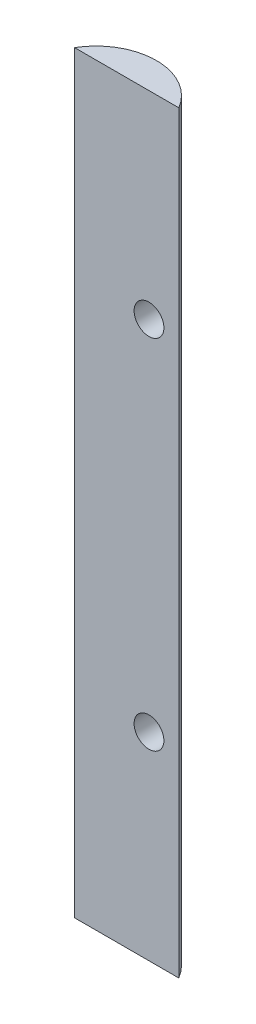
ISO-10303-21;
HEADER;
FILE_DESCRIPTION(('STEP AP214'),'2;1');
FILE_NAME('part.step','',(''),(''),'','','');
FILE_SCHEMA(('AUTOMOTIVE_DESIGN { 1 0 10303 214 1 1 1 1 }'));
ENDSEC;
DATA;
#1=APPLICATION_CONTEXT('core data for automotive mechanical design processes');
#2=APPLICATION_PROTOCOL_DEFINITION('international standard','automotive_design',2000,#1);
#3=PRODUCT_CONTEXT('',#1,'mechanical');
#4=PRODUCT('Part','Part','',(#3));
#5=PRODUCT_RELATED_PRODUCT_CATEGORY('part','',(#4));
#6=PRODUCT_DEFINITION_FORMATION('','',#4);
#7=PRODUCT_DEFINITION_CONTEXT('part definition',#1,'design');
#8=PRODUCT_DEFINITION('design','',#6,#7);
#9=PRODUCT_DEFINITION_SHAPE('','',#8);
#10=(LENGTH_UNIT() NAMED_UNIT(*) SI_UNIT(.MILLI.,.METRE.));
#11=(NAMED_UNIT(*) PLANE_ANGLE_UNIT() SI_UNIT($,.RADIAN.));
#12=(NAMED_UNIT(*) SI_UNIT($,.STERADIAN.) SOLID_ANGLE_UNIT());
#13=UNCERTAINTY_MEASURE_WITH_UNIT(LENGTH_MEASURE(1.E-05),#10,'distance_accuracy_value','');
#14=(GEOMETRIC_REPRESENTATION_CONTEXT(3) GLOBAL_UNCERTAINTY_ASSIGNED_CONTEXT((#13)) GLOBAL_UNIT_ASSIGNED_CONTEXT((#10,
#11,#12)) REPRESENTATION_CONTEXT('',''));
#15=CARTESIAN_POINT('',(0.,0.,0.));
#16=DIRECTION('',(0.,0.,1.));
#17=DIRECTION('',(1.,0.,0.));
#18=AXIS2_PLACEMENT_3D('',#15,#16,#17);
#19=CARTESIAN_POINT('',(0.,154.301952,0.));
#20=DIRECTION('',(0.,0.,-1.));
#21=DIRECTION('',(-1.,0.,0.));
#22=AXIS2_PLACEMENT_3D('',#19,#20,#21);
#23=PLANE('',#22);
#24=CARTESIAN_POINT('',(0.,35.875976,0.));
#25=DIRECTION('',(0.,0.,1.));
#26=DIRECTION('',(1.,0.,0.));
#27=AXIS2_PLACEMENT_3D('',#24,#25,#26);
#28=CIRCLE('',#27,3.17499999999999);
#29=CARTESIAN_POINT('',(3.17499999999999,35.875976,0.));
#30=VERTEX_POINT('',#29);
#31=EDGE_CURVE('E99',#30,#30,#28,.T.);
#32=ORIENTED_EDGE('',*,*,#31,.F.);
#33=EDGE_LOOP('',(#32));
#34=FACE_BOUND('',#33,.T.);
#35=CARTESIAN_POINT('',(0.,112.075976,0.));
#36=DIRECTION('',(0.,0.,1.));
#37=DIRECTION('',(1.,0.,0.));
#38=AXIS2_PLACEMENT_3D('',#35,#36,#37);
#39=CIRCLE('',#38,3.17499999999999);
#40=CARTESIAN_POINT('',(3.17499999999998,112.075976,0.));
#41=VERTEX_POINT('',#40);
#42=EDGE_CURVE('E125',#41,#41,#39,.T.);
#43=ORIENTED_EDGE('',*,*,#42,.F.);
#44=EDGE_LOOP('',(#43));
#45=FACE_BOUND('',#44,.T.);
#46=DIRECTION('',(1.,0.,0.));
#47=VECTOR('',#46,1.);
#48=CARTESIAN_POINT('',(0.,-6.35,0.));
#49=LINE('',#48,#47);
#50=CARTESIAN_POINT('',(-15.875,-6.35,0.));
#51=VERTEX_POINT('',#50);
#52=CARTESIAN_POINT('',(6.35,-6.35,0.));
#53=VERTEX_POINT('',#52);
#54=EDGE_CURVE('E74',#51,#53,#49,.T.);
#55=ORIENTED_EDGE('',*,*,#54,.T.);
#56=DIRECTION('',(0.,-1.,0.));
#57=VECTOR('',#56,1.);
#58=CARTESIAN_POINT('',(6.35,154.301952,0.));
#59=LINE('',#58,#57);
#60=CARTESIAN_POINT('',(6.35,154.301952,0.));
#61=VERTEX_POINT('',#60);
#62=EDGE_CURVE('E11',#61,#53,#59,.T.);
#63=ORIENTED_EDGE('',*,*,#62,.F.);
#64=DIRECTION('',(1.,0.,0.));
#65=VECTOR('',#64,1.);
#66=CARTESIAN_POINT('',(0.,154.301952,0.));
#67=LINE('',#66,#65);
#68=CARTESIAN_POINT('',(-15.875,154.301952,0.));
#69=VERTEX_POINT('',#68);
#70=EDGE_CURVE('E86',#69,#61,#67,.T.);
#71=ORIENTED_EDGE('',*,*,#70,.F.);
#72=DIRECTION('',(0.,-1.,0.));
#73=VECTOR('',#72,1.);
#74=CARTESIAN_POINT('',(-15.875,154.301952,0.));
#75=LINE('',#74,#73);
#76=EDGE_CURVE('E57',#69,#51,#75,.T.);
#77=ORIENTED_EDGE('',*,*,#76,.T.);
#78=EDGE_LOOP('',(#55,#63,#71,#77));
#79=FACE_BOUND('',#78,.T.);
#80=ADVANCED_FACE('F43',(#34,#45,#79),#23,.F.);
#81=CARTESIAN_POINT('',(-4.7625,154.301952,6.5484375));
#82=DIRECTION('',(0.,-1.,0.));
#83=DIRECTION('',(0.,0.,-1.));
#84=AXIS2_PLACEMENT_3D('',#81,#82,#83);
#85=CYLINDRICAL_SURFACE('',#84,12.8984375);
#86=CARTESIAN_POINT('',(3.17499999999999,35.875976,-3.61845896310054));
#87=CARTESIAN_POINT('',(3.17500029155845,35.9532460701708,-3.61845865162707));
#88=CARTESIAN_POINT('',(3.17217494628215,36.0305127414857,-3.62066641748479));
#89=CARTESIAN_POINT('',(3.16092477458739,36.1844165006741,-3.62943459894673));
#90=CARTESIAN_POINT('',(3.15249779231336,36.2610533346468,-3.6359966903624));
#91=CARTESIAN_POINT('',(3.13018830916981,36.4130458067568,-3.65329567583613));
#92=CARTESIAN_POINT('',(3.11630605119873,36.4884015017814,-3.66403238401741));
#93=CARTESIAN_POINT('',(3.08331514599963,36.6373033946925,-3.68939941002584));
#94=CARTESIAN_POINT('',(3.06420415714725,36.7108487657243,-3.7040314722612));
#95=CARTESIAN_POINT('',(2.99970218374854,36.9271174174017,-3.75305885545857));
#96=CARTESIAN_POINT('',(2.94697916438839,37.0665468482926,-3.79271518717727));
#97=CARTESIAN_POINT('',(2.82442881282292,37.3336781756134,-3.88295570262731));
#98=CARTESIAN_POINT('',(2.7545956444484,37.4613760500019,-3.93354361435852));
#99=CARTESIAN_POINT('',(2.59237992999635,37.7158578374709,-4.04808197326832));
#100=CARTESIAN_POINT('',(2.49844020076017,37.8412715954862,-4.11286301294359));
#101=CARTESIAN_POINT('',(2.29521823437964,38.0752138533229,-4.24847208060614));
#102=CARTESIAN_POINT('',(2.18592793531069,38.183733416977,-4.31930327835023));
#103=CARTESIAN_POINT('',(1.93138065942859,38.4025908557397,-4.47826997752821));
#104=CARTESIAN_POINT('',(1.78326915895043,38.5091374108075,-4.56708150040062));
#105=CARTESIAN_POINT('',(1.47119073823516,38.6954278022771,-4.74506321575416));
#106=CARTESIAN_POINT('',(1.30721296467085,38.7751531223092,-4.83423361318672));
#107=CARTESIAN_POINT('',(0.951295750286282,38.9116014809198,-5.01726678919524));
#108=CARTESIAN_POINT('',(0.758165872020517,38.9656695573429,-5.11084798187377));
#109=CARTESIAN_POINT('',(0.461109140868173,39.0189307940601,-5.24544016431096));
#110=CARTESIAN_POINT('',(0.360810762795933,39.0320439716694,-5.28936166307805));
#111=CARTESIAN_POINT('',(0.15846509509223,39.0486403343744,-5.37489298816599));
#112=CARTESIAN_POINT('',(0.0564187624306947,39.0521286293902,-5.41650402962234));
#113=CARTESIAN_POINT('',(-0.143697886170491,39.049225369538,-5.49512385220796));
#114=CARTESIAN_POINT('',(-0.241726201201153,39.0432962697464,-5.53225742551915));
#115=CARTESIAN_POINT('',(-0.437737274208508,39.0221990611551,-5.60380473376646));
#116=CARTESIAN_POINT('',(-0.535720030560133,39.0070355550416,-5.63821981402773));
#117=CARTESIAN_POINT('',(-0.730737999312872,38.9673423451485,-5.70412048241188));
#118=CARTESIAN_POINT('',(-0.827773509636955,38.9428156903861,-5.73560702003919));
#119=CARTESIAN_POINT('',(-1.0199433424238,38.8843681928637,-5.79551187375221));
#120=CARTESIAN_POINT('',(-1.11507785488985,38.8504482940378,-5.82393049773622));
#121=CARTESIAN_POINT('',(-1.2932752926261,38.7770830333219,-5.8750043601246));
#122=CARTESIAN_POINT('',(-1.3766104012884,38.7384996486948,-5.89795138845065));
#123=CARTESIAN_POINT('',(-1.54016736468118,38.6539228516425,-5.94129517591087));
#124=CARTESIAN_POINT('',(-1.62038811983223,38.6079268510579,-5.96169103985667));
#125=CARTESIAN_POINT('',(-1.77687845129753,38.5088252250418,-5.99995831517187));
#126=CARTESIAN_POINT('',(-1.85315059963564,38.4557243104882,-6.01783138326943));
#127=CARTESIAN_POINT('',(-2.00107961503945,38.3427521830638,-6.05116594048672));
#128=CARTESIAN_POINT('',(-2.07273482176761,38.282878555695,-6.06662656485746));
#129=CARTESIAN_POINT('',(-2.27159400513747,38.1011379662489,-6.10788997306091));
#130=CARTESIAN_POINT('',(-2.39212476680084,37.9711238078877,-6.13080529239027));
#131=CARTESIAN_POINT('',(-2.61018571307227,37.6922716410865,-6.169643174857));
#132=CARTESIAN_POINT('',(-2.70771789937332,37.5434352725808,-6.18556634666365));
#133=CARTESIAN_POINT('',(-2.87574692225581,37.2329877816891,-6.21153952657473));
#134=CARTESIAN_POINT('',(-2.94654490001103,37.0715453031202,-6.22165566629257));
#135=CARTESIAN_POINT('',(-3.06051426189999,36.7389839302186,-6.23734638899209));
#136=CARTESIAN_POINT('',(-3.1036851570565,36.5678648646765,-6.24292089159091));
#137=CARTESIAN_POINT('',(-3.16124439987612,36.2200206249881,-6.25025492095319));
#138=CARTESIAN_POINT('',(-3.17550914635836,36.0432746451871,-6.25199806771476));
#139=CARTESIAN_POINT('',(-3.17446299904402,35.6898690405533,-6.25186828729976));
#140=CARTESIAN_POINT('',(-3.1591514595007,35.5132094176902,-6.24999528117078));
#141=CARTESIAN_POINT('',(-3.09932960260838,35.1645382371296,-6.24235818988753));
#142=CARTESIAN_POINT('',(-3.05474731888306,34.9925392263368,-6.2365845133512));
#143=CARTESIAN_POINT('',(-2.93765612238383,34.6585555683284,-6.22039579970276));
#144=CARTESIAN_POINT('',(-2.8651476977294,34.4965707461328,-6.20998084371483));
#145=CARTESIAN_POINT('',(-2.69464055060395,34.1876044041569,-6.18345321124056));
#146=CARTESIAN_POINT('',(-2.59669886748819,34.0405903236084,-6.16735325583885));
#147=CARTESIAN_POINT('',(-2.37838771763342,33.7653493257539,-6.12823219486351));
#148=CARTESIAN_POINT('',(-2.25802014982715,33.6371208194028,-6.10521167519394));
#149=CARTESIAN_POINT('',(-1.99941744380487,33.4034910568398,-6.05126056417378));
#150=CARTESIAN_POINT('',(-1.86126578240751,33.2979889483569,-6.02036630640185));
#151=CARTESIAN_POINT('',(-1.57125841800309,33.1116529132524,-5.94987856073665));
#152=CARTESIAN_POINT('',(-1.41940302371465,33.0308184310966,-5.910285268787));
#153=CARTESIAN_POINT('',(-1.1055099451504,32.8947009667696,-5.82180553620153));
#154=CARTESIAN_POINT('',(-0.943393885269857,32.8396510085681,-5.77283977329668));
#155=CARTESIAN_POINT('',(-0.615164246925477,32.7565397418925,-5.66627030457636));
#156=CARTESIAN_POINT('',(-0.449049882986556,32.7284837815405,-5.60866488966228));
#157=CARTESIAN_POINT('',(-0.109458564307639,32.6980725021982,-5.4829048252979));
#158=CARTESIAN_POINT('',(0.063994138427292,32.6969984952479,-5.41437955571862));
#159=CARTESIAN_POINT('',(0.406009243876506,32.7223713421909,-5.27064333297133));
#160=CARTESIAN_POINT('',(0.574570106965336,32.748826765999,-5.1954303045711));
#161=CARTESIAN_POINT('',(0.917794182473879,32.8309643448933,-5.03357505540364));
#162=CARTESIAN_POINT('',(1.09169140536315,32.8890111406032,-4.9465093365185));
#163=CARTESIAN_POINT('',(1.42611850843885,33.0334354511295,-4.76997774068824));
#164=CARTESIAN_POINT('',(1.58663659159165,33.1198376437102,-4.68050983561371));
#165=CARTESIAN_POINT('',(1.90346369918747,33.3272184478596,-4.49560605638029));
#166=CARTESIAN_POINT('',(2.05837804151772,33.4504312658432,-4.40027394193835));
#167=CARTESIAN_POINT('',(2.34470378385709,33.7260021221634,-4.21660928889522));
#168=CARTESIAN_POINT('',(2.4761352154676,33.8783350883122,-4.12827082068667));
#169=CARTESIAN_POINT('',(2.68414340342812,34.1727947747334,-3.98386963689914));
#170=CARTESIAN_POINT('',(2.76641145809164,34.3095436202933,-3.92501222527243));
#171=CARTESIAN_POINT('',(2.91081345377314,34.5978315173857,-3.81968463242392));
#172=CARTESIAN_POINT('',(2.97296687081608,34.7493560761584,-3.7732024766262));
#173=CARTESIAN_POINT('',(3.04804529007878,34.9834502824975,-3.71635786454596));
#174=CARTESIAN_POINT('',(3.06990380991776,35.0617339415551,-3.69966984511348));
#175=CARTESIAN_POINT('',(3.10767219938744,35.2205056158014,-3.67069401211238));
#176=CARTESIAN_POINT('',(3.12358517824932,35.30099245513,-3.65840389879346));
#177=CARTESIAN_POINT('',(3.14916600743887,35.4634917928754,-3.63858824894905));
#178=CARTESIAN_POINT('',(3.15883683517378,35.545503544699,-3.63106044091348));
#179=CARTESIAN_POINT('',(3.17175344510506,35.7103368714405,-3.62099614366396));
#180=CARTESIAN_POINT('',(3.17499968750934,35.7931583879259,-3.618459296936));
#181=CARTESIAN_POINT('',(3.17499999999999,35.875976,-3.61845896310054));
#182=B_SPLINE_CURVE_WITH_KNOTS('',3,(#86,#87,#88,#89,#90,#91,#92,#93,#94,#95,#96,#97,#98,#99,
#100,#101,#102,#103,#104,#105,#106,#107,#108,#109,#110,#111,#112,#113,#114,#115,#116,#117,#118,
#119,#120,#121,#122,#123,#124,#125,#126,#127,#128,#129,#130,#131,#132,#133,#134,#135,#136,#137,
#138,#139,#140,#141,#142,#143,#144,#145,#146,#147,#148,#149,#150,#151,#152,#153,#154,#155,#156,
#157,#158,#159,#160,#161,#162,#163,#164,#165,#166,#167,#168,#169,#170,#171,#172,#173,#174,#175,
#176,#177,#178,#179,#180,#181),.UNSPECIFIED.,.T.,.F.,(4,2,2,2,2,2,2,2,2,2,2,2,2,2,2,2,2,2,2,2,2,
2,2,2,2,2,2,2,2,2,2,2,2,2,2,2,2,2,2,2,2,2,2,2,2,2,2,4),(0.,0.23172170254418,0.463532637571479,
0.695333252289376,0.927237846532124,1.38780878735856,1.84853704540815,2.35536912389957,
2.86246838644238,3.46869500436954,4.07533928356594,4.735587075844,5.0660447042575,
5.39632685652518,5.71088488491669,6.02528625696997,6.33958533452528,6.65385283938741,
6.93745872275159,7.22116384420984,7.50468178004908,7.78830111158174,8.32177184268101,
8.8551961257254,9.38241858057932,9.90965036659034,10.439131851098,10.9686248960431,
11.4994246762914,12.0302151791403,12.5598254035064,13.0893908029968,13.6165554088367,
14.1437081416398,14.6755371559432,15.2074715159301,15.7646208143044,16.3219436052166,
16.9282554412655,17.5350963574278,18.1911032211856,18.8465477923047,19.3549401883814,
19.8628388497612,20.1114634329343,20.3599578148523,20.6083335811238,20.8566915550203),.UNSPECIFIED.);
#183=CARTESIAN_POINT('',(3.17499999999999,35.875976,-3.61845896310054));
#184=VERTEX_POINT('',#183);
#185=EDGE_CURVE('E46',#184,#184,#182,.T.);
#186=ORIENTED_EDGE('',*,*,#185,.T.);
#187=EDGE_LOOP('',(#186));
#188=FACE_BOUND('',#187,.T.);
#189=CARTESIAN_POINT('',(3.17499999999998,112.075976,-3.61845896310055));
#190=CARTESIAN_POINT('',(3.17500029155843,112.153246070171,-3.61845865162708));
#191=CARTESIAN_POINT('',(3.17217494628213,112.230512741486,-3.6206664174848));
#192=CARTESIAN_POINT('',(3.16092477458737,112.384416500674,-3.62943459894674));
#193=CARTESIAN_POINT('',(3.15249779231334,112.461053334647,-3.63599669036241));
#194=CARTESIAN_POINT('',(3.1301883091698,112.613045806757,-3.65329567583614));
#195=CARTESIAN_POINT('',(3.11630605119871,112.688401501781,-3.66403238401741));
#196=CARTESIAN_POINT('',(3.08331514599962,112.837303394693,-3.68939941002585));
#197=CARTESIAN_POINT('',(3.06420415714724,112.910848765724,-3.70403147226121));
#198=CARTESIAN_POINT('',(2.99970218374853,113.127117417402,-3.75305885545858));
#199=CARTESIAN_POINT('',(2.94697916438838,113.266546848293,-3.79271518717729));
#200=CARTESIAN_POINT('',(2.8244288128229,113.533678175613,-3.88295570262733));
#201=CARTESIAN_POINT('',(2.75459564444838,113.661376050002,-3.93354361435853));
#202=CARTESIAN_POINT('',(2.59237992999633,113.915857837471,-4.04808197326834));
#203=CARTESIAN_POINT('',(2.49844020076014,114.041271595486,-4.1128630129436));
#204=CARTESIAN_POINT('',(2.29521823437962,114.275213853323,-4.24847208060616));
#205=CARTESIAN_POINT('',(2.18592793531068,114.383733416977,-4.31930327835023));
#206=CARTESIAN_POINT('',(1.93138065942857,114.60259085574,-4.47826997752822));
#207=CARTESIAN_POINT('',(1.78326915895041,114.709137410808,-4.56708150040063));
#208=CARTESIAN_POINT('',(1.47119073823514,114.895427802277,-4.74506321575417));
#209=CARTESIAN_POINT('',(1.30721296467083,114.975153122309,-4.83423361318673));
#210=CARTESIAN_POINT('',(0.951295750286266,115.11160148092,-5.01726678919525));
#211=CARTESIAN_POINT('',(0.7581658720205,115.165669557343,-5.11084798187378));
#212=CARTESIAN_POINT('',(0.461109140868153,115.21893079406,-5.24544016431097));
#213=CARTESIAN_POINT('',(0.360810762795913,115.232043971669,-5.28936166307805));
#214=CARTESIAN_POINT('',(0.158465095092209,115.248640334374,-5.374892988166));
#215=CARTESIAN_POINT('',(0.0564187624306733,115.25212862939,-5.41650402962235));
#216=CARTESIAN_POINT('',(-0.143697886170512,115.249225369538,-5.49512385220797));
#217=CARTESIAN_POINT('',(-0.241726201201174,115.243296269746,-5.53225742551916));
#218=CARTESIAN_POINT('',(-0.437737274208529,115.222199061155,-5.60380473376646));
#219=CARTESIAN_POINT('',(-0.535720030560155,115.207035555042,-5.63821981402774));
#220=CARTESIAN_POINT('',(-0.730737999312894,115.167342345149,-5.70412048241189));
#221=CARTESIAN_POINT('',(-0.827773509636976,115.142815690386,-5.7356070200392));
#222=CARTESIAN_POINT('',(-1.01994334242381,115.084368192864,-5.79551187375221));
#223=CARTESIAN_POINT('',(-1.11507785488987,115.050448294038,-5.82393049773622));
#224=CARTESIAN_POINT('',(-1.29327529262612,114.977083033322,-5.8750043601246));
#225=CARTESIAN_POINT('',(-1.37661040128841,114.938499648695,-5.89795138845065));
#226=CARTESIAN_POINT('',(-1.54016736468119,114.853922851643,-5.94129517591087));
#227=CARTESIAN_POINT('',(-1.62038811983224,114.807926851058,-5.96169103985667));
#228=CARTESIAN_POINT('',(-1.77687845129754,114.708825225042,-5.99995831517187));
#229=CARTESIAN_POINT('',(-1.85315059963566,114.655724310488,-6.01783138326944));
#230=CARTESIAN_POINT('',(-2.00107961503946,114.542752183064,-6.05116594048672));
#231=CARTESIAN_POINT('',(-2.07273482176763,114.482878555695,-6.06662656485746));
#232=CARTESIAN_POINT('',(-2.27159400513748,114.301137966249,-6.10788997306092));
#233=CARTESIAN_POINT('',(-2.39212476680085,114.171123807888,-6.13080529239027));
#234=CARTESIAN_POINT('',(-2.61018571307228,113.892271641086,-6.169643174857));
#235=CARTESIAN_POINT('',(-2.70771789937333,113.743435272581,-6.18556634666366));
#236=CARTESIAN_POINT('',(-2.87574692225583,113.432987781689,-6.21153952657473));
#237=CARTESIAN_POINT('',(-2.94654490001105,113.27154530312,-6.22165566629257));
#238=CARTESIAN_POINT('',(-3.06051426190001,112.938983930219,-6.2373463889921));
#239=CARTESIAN_POINT('',(-3.10368515705652,112.767864864676,-6.24292089159092));
#240=CARTESIAN_POINT('',(-3.16124439987613,112.420020624988,-6.25025492095319));
#241=CARTESIAN_POINT('',(-3.17550914635837,112.243274645187,-6.25199806771476));
#242=CARTESIAN_POINT('',(-3.17446299904403,111.889869040553,-6.25186828729976));
#243=CARTESIAN_POINT('',(-3.15915145950071,111.71320941769,-6.24999528117079));
#244=CARTESIAN_POINT('',(-3.09932960260839,111.36453823713,-6.24235818988753));
#245=CARTESIAN_POINT('',(-3.05474731888307,111.192539226337,-6.2365845133512));
#246=CARTESIAN_POINT('',(-2.93765612238384,110.858555568328,-6.22039579970276));
#247=CARTESIAN_POINT('',(-2.86514769772941,110.696570746133,-6.20998084371483));
#248=CARTESIAN_POINT('',(-2.69464055060396,110.387604404157,-6.18345321124056));
#249=CARTESIAN_POINT('',(-2.5966988674882,110.240590323608,-6.16735325583885));
#250=CARTESIAN_POINT('',(-2.37838771763343,109.965349325754,-6.12823219486352));
#251=CARTESIAN_POINT('',(-2.25802014982716,109.837120819403,-6.10521167519394));
#252=CARTESIAN_POINT('',(-1.99941744380488,109.60349105684,-6.05126056417378));
#253=CARTESIAN_POINT('',(-1.86126578240752,109.497988948357,-6.02036630640185));
#254=CARTESIAN_POINT('',(-1.5712584180031,109.311652913252,-5.94987856073665));
#255=CARTESIAN_POINT('',(-1.41940302371466,109.230818431097,-5.91028526878701));
#256=CARTESIAN_POINT('',(-1.10550994515041,109.09470096677,-5.82180553620153));
#257=CARTESIAN_POINT('',(-0.943393885269866,109.039651008568,-5.77283977329668));
#258=CARTESIAN_POINT('',(-0.615164246925485,108.956539741892,-5.66627030457636));
#259=CARTESIAN_POINT('',(-0.449049882986565,108.92848378154,-5.60866488966228));
#260=CARTESIAN_POINT('',(-0.109458564307648,108.898072502198,-5.4829048252979));
#261=CARTESIAN_POINT('',(0.063994138427282,108.896998495248,-5.41437955571862));
#262=CARTESIAN_POINT('',(0.406009243876495,108.922371342191,-5.27064333297133));
#263=CARTESIAN_POINT('',(0.574570106965326,108.948826765999,-5.19543030457111));
#264=CARTESIAN_POINT('',(0.91779418247387,109.030964344893,-5.03357505540365));
#265=CARTESIAN_POINT('',(1.09169140536314,109.089011140603,-4.94650933651851));
#266=CARTESIAN_POINT('',(1.42611850843885,109.233435451129,-4.76997774068824));
#267=CARTESIAN_POINT('',(1.58663659159164,109.31983764371,-4.68050983561371));
#268=CARTESIAN_POINT('',(1.90346369918746,109.52721844786,-4.4956060563803));
#269=CARTESIAN_POINT('',(2.05837804151771,109.650431265843,-4.40027394193836));
#270=CARTESIAN_POINT('',(2.34470378385708,109.926002122163,-4.21660928889523));
#271=CARTESIAN_POINT('',(2.47613521546759,110.078335088312,-4.12827082068668));
#272=CARTESIAN_POINT('',(2.6841434034281,110.372794774733,-3.98386963689915));
#273=CARTESIAN_POINT('',(2.76641145809163,110.509543620293,-3.92501222527244));
#274=CARTESIAN_POINT('',(2.91081345377313,110.797831517386,-3.81968463242393));
#275=CARTESIAN_POINT('',(2.97296687081607,110.949356076158,-3.77320247662621));
#276=CARTESIAN_POINT('',(3.04804529007877,111.183450282498,-3.71635786454597));
#277=CARTESIAN_POINT('',(3.06990380991775,111.261733941555,-3.69966984511349));
#278=CARTESIAN_POINT('',(3.10767219938743,111.420505615801,-3.67069401211239));
#279=CARTESIAN_POINT('',(3.12358517824931,111.50099245513,-3.65840389879348));
#280=CARTESIAN_POINT('',(3.14916600743886,111.663491792875,-3.63858824894907));
#281=CARTESIAN_POINT('',(3.15883683517377,111.745503544699,-3.63106044091349));
#282=CARTESIAN_POINT('',(3.17175344510504,111.910336871441,-3.62099614366397));
#283=CARTESIAN_POINT('',(3.17499968750932,111.993158387926,-3.61845929693601));
#284=CARTESIAN_POINT('',(3.17499999999998,112.075976,-3.61845896310055));
#285=B_SPLINE_CURVE_WITH_KNOTS('',3,(#189,#190,#191,#192,#193,#194,#195,#196,#197,#198,#199,
#200,#201,#202,#203,#204,#205,#206,#207,#208,#209,#210,#211,#212,#213,#214,#215,#216,#217,#218,
#219,#220,#221,#222,#223,#224,#225,#226,#227,#228,#229,#230,#231,#232,#233,#234,#235,#236,#237,
#238,#239,#240,#241,#242,#243,#244,#245,#246,#247,#248,#249,#250,#251,#252,#253,#254,#255,#256,
#257,#258,#259,#260,#261,#262,#263,#264,#265,#266,#267,#268,#269,#270,#271,#272,#273,#274,#275,
#276,#277,#278,#279,#280,#281,#282,#283,#284),.UNSPECIFIED.,.T.,.F.,(4,2,2,2,2,2,2,2,2,2,2,2,2,
2,2,2,2,2,2,2,2,2,2,2,2,2,2,2,2,2,2,2,2,2,2,2,2,2,2,2,2,2,2,2,2,2,2,4),(0.,0.231721702544194,
0.463532637571486,0.695333252289375,0.927237846532124,1.38780878735856,1.84853704540816,
2.35536912389958,2.86246838644238,3.46869500436954,4.07533928356595,4.735587075844,
5.06604470425751,5.39632685652519,5.71088488491669,6.02528625696997,6.33958533452528,
6.65385283938742,6.93745872275158,7.22116384420983,7.50468178004908,7.78830111158174,
8.32177184268101,8.85519612572541,9.38241858057932,9.90965036659033,10.439131851098,
10.9686248960431,11.4994246762914,12.0302151791403,12.5598254035064,13.0893908029968,
13.6165554088367,14.1437081416398,14.6755371559432,15.2074715159301,15.7646208143044,
16.3219436052166,16.9282554412655,17.5350963574278,18.1911032211856,18.8465477923047,
19.3549401883814,19.8628388497612,20.1114634329343,20.3599578148523,20.6083335811238,
20.8566915550203),.UNSPECIFIED.);
#286=CARTESIAN_POINT('',(3.17499999999998,112.075976,-3.61845896310055));
#287=VERTEX_POINT('',#286);
#288=EDGE_CURVE('E92',#287,#287,#285,.T.);
#289=ORIENTED_EDGE('',*,*,#288,.T.);
#290=EDGE_LOOP('',(#289));
#291=FACE_BOUND('',#290,.T.);
#292=CARTESIAN_POINT('',(-4.7625,-6.35,6.5484375));
#293=DIRECTION('',(0.,1.,0.));
#294=DIRECTION('',(0.,0.,-1.));
#295=AXIS2_PLACEMENT_3D('',#292,#293,#294);
#296=CIRCLE('',#295,12.8984375);
#297=EDGE_CURVE('E79',#53,#51,#296,.T.);
#298=ORIENTED_EDGE('',*,*,#297,.T.);
#299=ORIENTED_EDGE('',*,*,#76,.F.);
#300=CARTESIAN_POINT('',(-4.7625,154.301952,6.5484375));
#301=DIRECTION('',(0.,1.,0.));
#302=DIRECTION('',(0.,0.,-1.));
#303=AXIS2_PLACEMENT_3D('',#300,#301,#302);
#304=CIRCLE('',#303,12.8984375);
#305=EDGE_CURVE('E65',#61,#69,#304,.T.);
#306=ORIENTED_EDGE('',*,*,#305,.F.);
#307=ORIENTED_EDGE('',*,*,#62,.T.);
#308=EDGE_LOOP('',(#298,#299,#306,#307));
#309=FACE_BOUND('',#308,.T.);
#310=ADVANCED_FACE('F83',(#188,#291,#309),#85,.T.);
#311=CARTESIAN_POINT('',(-4.7625,154.301952,6.5484375));
#312=DIRECTION('',(0.,-1.,0.));
#313=DIRECTION('',(0.,0.,-1.));
#314=AXIS2_PLACEMENT_3D('',#311,#312,#313);
#315=PLANE('',#314);
#316=ORIENTED_EDGE('',*,*,#70,.T.);
#317=ORIENTED_EDGE('',*,*,#305,.T.);
#318=EDGE_LOOP('',(#316,#317));
#319=FACE_BOUND('',#318,.T.);
#320=ADVANCED_FACE('F109',(#319),#315,.F.);
#321=CARTESIAN_POINT('',(-4.7625,-6.35,6.5484375));
#322=DIRECTION('',(0.,-1.,0.));
#323=DIRECTION('',(0.,0.,-1.));
#324=AXIS2_PLACEMENT_3D('',#321,#322,#323);
#325=PLANE('',#324);
#326=ORIENTED_EDGE('',*,*,#54,.F.);
#327=ORIENTED_EDGE('',*,*,#297,.F.);
#328=EDGE_LOOP('',(#326,#327));
#329=FACE_BOUND('',#328,.T.);
#330=ADVANCED_FACE('F78',(#329),#325,.T.);
#331=CARTESIAN_POINT('',(0.,112.075976,-6.35));
#332=DIRECTION('',(0.,0.,1.));
#333=DIRECTION('',(1.,0.,0.));
#334=AXIS2_PLACEMENT_3D('',#331,#332,#333);
#335=CYLINDRICAL_SURFACE('',#334,3.17499999999999);
#336=ORIENTED_EDGE('',*,*,#42,.T.);
#337=EDGE_LOOP('',(#336));
#338=FACE_BOUND('',#337,.T.);
#339=ORIENTED_EDGE('',*,*,#288,.F.);
#340=EDGE_LOOP('',(#339));
#341=FACE_BOUND('',#340,.T.);
#342=ADVANCED_FACE('F102',(#338,#341),#335,.F.);
#343=CARTESIAN_POINT('',(0.,35.875976,-6.35));
#344=DIRECTION('',(0.,0.,1.));
#345=DIRECTION('',(1.,0.,0.));
#346=AXIS2_PLACEMENT_3D('',#343,#344,#345);
#347=CYLINDRICAL_SURFACE('',#346,3.17499999999999);
#348=ORIENTED_EDGE('',*,*,#31,.T.);
#349=EDGE_LOOP('',(#348));
#350=FACE_BOUND('',#349,.T.);
#351=ORIENTED_EDGE('',*,*,#185,.F.);
#352=EDGE_LOOP('',(#351));
#353=FACE_BOUND('',#352,.T.);
#354=ADVANCED_FACE('F106',(#350,#353),#347,.F.);
#355=CLOSED_SHELL('',(#80,#310,#320,#330,#342,#354));
#356=MANIFOLD_SOLID_BREP('B2',#355);
#357=ADVANCED_BREP_SHAPE_REPRESENTATION('',(#18,#356),#14);
#358=SHAPE_DEFINITION_REPRESENTATION(#9,#357);
ENDSEC;
END-ISO-10303-21;
